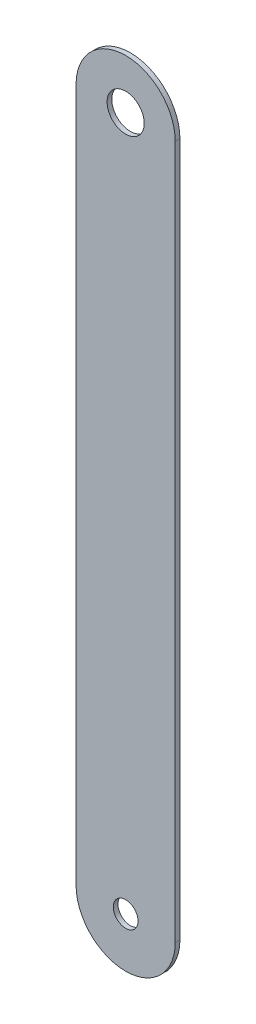
ISO-10303-21;
HEADER;
FILE_DESCRIPTION(('STEP AP214'),'2;1');
FILE_NAME('part.step','',(''),(''),'','','');
FILE_SCHEMA(('AUTOMOTIVE_DESIGN { 1 0 10303 214 1 1 1 1 }'));
ENDSEC;
DATA;
#1=APPLICATION_CONTEXT('core data for automotive mechanical design processes');
#2=APPLICATION_PROTOCOL_DEFINITION('international standard','automotive_design',2000,#1);
#3=PRODUCT_CONTEXT('',#1,'mechanical');
#4=PRODUCT('Part','Part','',(#3));
#5=PRODUCT_RELATED_PRODUCT_CATEGORY('part','',(#4));
#6=PRODUCT_DEFINITION_FORMATION('','',#4);
#7=PRODUCT_DEFINITION_CONTEXT('part definition',#1,'design');
#8=PRODUCT_DEFINITION('design','',#6,#7);
#9=PRODUCT_DEFINITION_SHAPE('','',#8);
#10=(LENGTH_UNIT() NAMED_UNIT(*) SI_UNIT(.MILLI.,.METRE.));
#11=(NAMED_UNIT(*) PLANE_ANGLE_UNIT() SI_UNIT($,.RADIAN.));
#12=(NAMED_UNIT(*) SI_UNIT($,.STERADIAN.) SOLID_ANGLE_UNIT());
#13=UNCERTAINTY_MEASURE_WITH_UNIT(LENGTH_MEASURE(1.E-05),#10,'distance_accuracy_value','');
#14=(GEOMETRIC_REPRESENTATION_CONTEXT(3) GLOBAL_UNCERTAINTY_ASSIGNED_CONTEXT((#13)) GLOBAL_UNIT_ASSIGNED_CONTEXT((#10,
#11,#12)) REPRESENTATION_CONTEXT('',''));
#15=CARTESIAN_POINT('',(0.,0.,0.));
#16=DIRECTION('',(0.,0.,1.));
#17=DIRECTION('',(1.,0.,0.));
#18=AXIS2_PLACEMENT_3D('',#15,#16,#17);
#19=CARTESIAN_POINT('',(0.,-88.9,1.2));
#20=DIRECTION('',(0.,0.,-1.));
#21=DIRECTION('',(-1.,0.,0.));
#22=AXIS2_PLACEMENT_3D('',#19,#20,#21);
#23=CYLINDRICAL_SURFACE('',#22,12.7);
#24=CARTESIAN_POINT('',(0.,-88.9,0.));
#25=DIRECTION('',(0.,0.,1.));
#26=DIRECTION('',(1.,0.,0.));
#27=AXIS2_PLACEMENT_3D('',#24,#25,#26);
#28=CIRCLE('',#27,12.7);
#29=CARTESIAN_POINT('',(-12.7,-88.9,0.));
#30=VERTEX_POINT('',#29);
#31=CARTESIAN_POINT('',(12.7,-88.9,0.));
#32=VERTEX_POINT('',#31);
#33=EDGE_CURVE('E104',#30,#32,#28,.T.);
#34=ORIENTED_EDGE('',*,*,#33,.T.);
#35=DIRECTION('',(0.,0.,-1.));
#36=VECTOR('',#35,1.);
#37=CARTESIAN_POINT('',(12.7,-88.9,1.2));
#38=LINE('',#37,#36);
#39=CARTESIAN_POINT('',(12.7,-88.9,1.2));
#40=VERTEX_POINT('',#39);
#41=EDGE_CURVE('E11',#40,#32,#38,.T.);
#42=ORIENTED_EDGE('',*,*,#41,.F.);
#43=CARTESIAN_POINT('',(0.,-88.9,1.2));
#44=DIRECTION('',(0.,0.,1.));
#45=DIRECTION('',(1.,0.,0.));
#46=AXIS2_PLACEMENT_3D('',#43,#44,#45);
#47=CIRCLE('',#46,12.7);
#48=CARTESIAN_POINT('',(-12.7,-88.9,1.2));
#49=VERTEX_POINT('',#48);
#50=EDGE_CURVE('E74',#49,#40,#47,.T.);
#51=ORIENTED_EDGE('',*,*,#50,.F.);
#52=DIRECTION('',(0.,0.,-1.));
#53=VECTOR('',#52,1.);
#54=CARTESIAN_POINT('',(-12.7,-88.9,1.2));
#55=LINE('',#54,#53);
#56=EDGE_CURVE('E103',#49,#30,#55,.T.);
#57=ORIENTED_EDGE('',*,*,#56,.T.);
#58=EDGE_LOOP('',(#34,#42,#51,#57));
#59=FACE_BOUND('',#58,.T.);
#60=ADVANCED_FACE('F35',(#59),#23,.T.);
#61=CARTESIAN_POINT('',(12.7,0.,1.2));
#62=DIRECTION('',(1.,0.,0.));
#63=DIRECTION('',(0.,1.,0.));
#64=AXIS2_PLACEMENT_3D('',#61,#62,#63);
#65=PLANE('',#64);
#66=DIRECTION('',(0.,-1.,0.));
#67=VECTOR('',#66,1.);
#68=CARTESIAN_POINT('',(12.7,0.,0.));
#69=LINE('',#68,#67);
#70=CARTESIAN_POINT('',(12.7,88.9,0.));
#71=VERTEX_POINT('',#70);
#72=EDGE_CURVE('E83',#71,#32,#69,.T.);
#73=ORIENTED_EDGE('',*,*,#72,.F.);
#74=DIRECTION('',(0.,0.,-1.));
#75=VECTOR('',#74,1.);
#76=CARTESIAN_POINT('',(12.7,88.9,1.2));
#77=LINE('',#76,#75);
#78=CARTESIAN_POINT('',(12.7,88.9,1.2));
#79=VERTEX_POINT('',#78);
#80=EDGE_CURVE('E43',#79,#71,#77,.T.);
#81=ORIENTED_EDGE('',*,*,#80,.F.);
#82=DIRECTION('',(0.,-1.,0.));
#83=VECTOR('',#82,1.);
#84=CARTESIAN_POINT('',(12.7,0.,1.2));
#85=LINE('',#84,#83);
#86=EDGE_CURVE('E81',#79,#40,#85,.T.);
#87=ORIENTED_EDGE('',*,*,#86,.T.);
#88=ORIENTED_EDGE('',*,*,#41,.T.);
#89=EDGE_LOOP('',(#73,#81,#87,#88));
#90=FACE_BOUND('',#89,.T.);
#91=ADVANCED_FACE('F80',(#90),#65,.T.);
#92=CARTESIAN_POINT('',(0.,88.9,1.2));
#93=DIRECTION('',(0.,0.,-1.));
#94=DIRECTION('',(-1.,0.,0.));
#95=AXIS2_PLACEMENT_3D('',#92,#93,#94);
#96=CYLINDRICAL_SURFACE('',#95,12.7);
#97=CARTESIAN_POINT('',(0.,88.9,0.));
#98=DIRECTION('',(0.,0.,1.));
#99=DIRECTION('',(1.,0.,0.));
#100=AXIS2_PLACEMENT_3D('',#97,#98,#99);
#101=CIRCLE('',#100,12.7);
#102=CARTESIAN_POINT('',(-12.7,88.9,0.));
#103=VERTEX_POINT('',#102);
#104=EDGE_CURVE('E108',#103,#71,#101,.F.);
#105=ORIENTED_EDGE('',*,*,#104,.F.);
#106=DIRECTION('',(0.,0.,-1.));
#107=VECTOR('',#106,1.);
#108=CARTESIAN_POINT('',(-12.7,88.9,1.2));
#109=LINE('',#108,#107);
#110=CARTESIAN_POINT('',(-12.7,88.9,1.2));
#111=VERTEX_POINT('',#110);
#112=EDGE_CURVE('E66',#111,#103,#109,.T.);
#113=ORIENTED_EDGE('',*,*,#112,.F.);
#114=CARTESIAN_POINT('',(0.,88.9,1.2));
#115=DIRECTION('',(0.,0.,1.));
#116=DIRECTION('',(1.,0.,0.));
#117=AXIS2_PLACEMENT_3D('',#114,#115,#116);
#118=CIRCLE('',#117,12.7);
#119=EDGE_CURVE('E90',#111,#79,#118,.F.);
#120=ORIENTED_EDGE('',*,*,#119,.T.);
#121=ORIENTED_EDGE('',*,*,#80,.T.);
#122=EDGE_LOOP('',(#105,#113,#120,#121));
#123=FACE_BOUND('',#122,.T.);
#124=ADVANCED_FACE('F92',(#123),#96,.T.);
#125=CARTESIAN_POINT('',(0.,-88.9,1.2));
#126=DIRECTION('',(0.,0.,-1.));
#127=DIRECTION('',(-1.,0.,0.));
#128=AXIS2_PLACEMENT_3D('',#125,#126,#127);
#129=CYLINDRICAL_SURFACE('',#128,3.175);
#130=CARTESIAN_POINT('',(0.,-88.9,1.2));
#131=DIRECTION('',(0.,0.,1.));
#132=DIRECTION('',(1.,0.,0.));
#133=AXIS2_PLACEMENT_3D('',#130,#131,#132);
#134=CIRCLE('',#133,3.175);
#135=CARTESIAN_POINT('',(3.17500000000001,-88.9,1.2));
#136=VERTEX_POINT('',#135);
#137=EDGE_CURVE('E94',#136,#136,#134,.T.);
#138=ORIENTED_EDGE('',*,*,#137,.T.);
#139=EDGE_LOOP('',(#138));
#140=FACE_BOUND('',#139,.T.);
#141=CARTESIAN_POINT('',(0.,-88.9,0.));
#142=DIRECTION('',(0.,0.,1.));
#143=DIRECTION('',(1.,0.,0.));
#144=AXIS2_PLACEMENT_3D('',#141,#142,#143);
#145=CIRCLE('',#144,3.175);
#146=CARTESIAN_POINT('',(3.17500000000001,-88.9,0.));
#147=VERTEX_POINT('',#146);
#148=EDGE_CURVE('E111',#147,#147,#145,.T.);
#149=ORIENTED_EDGE('',*,*,#148,.F.);
#150=EDGE_LOOP('',(#149));
#151=FACE_BOUND('',#150,.T.);
#152=ADVANCED_FACE('F139',(#140,#151),#129,.F.);
#153=CARTESIAN_POINT('',(-12.7,0.,1.2));
#154=DIRECTION('',(1.,0.,0.));
#155=DIRECTION('',(0.,1.,0.));
#156=AXIS2_PLACEMENT_3D('',#153,#154,#155);
#157=PLANE('',#156);
#158=DIRECTION('',(0.,-1.,0.));
#159=VECTOR('',#158,1.);
#160=CARTESIAN_POINT('',(-12.7,0.,0.));
#161=LINE('',#160,#159);
#162=EDGE_CURVE('E69',#103,#30,#161,.T.);
#163=ORIENTED_EDGE('',*,*,#162,.T.);
#164=ORIENTED_EDGE('',*,*,#56,.F.);
#165=DIRECTION('',(0.,-1.,0.));
#166=VECTOR('',#165,1.);
#167=CARTESIAN_POINT('',(-12.7,0.,1.2));
#168=LINE('',#167,#166);
#169=EDGE_CURVE('E51',#111,#49,#168,.T.);
#170=ORIENTED_EDGE('',*,*,#169,.F.);
#171=ORIENTED_EDGE('',*,*,#112,.T.);
#172=EDGE_LOOP('',(#163,#164,#170,#171));
#173=FACE_BOUND('',#172,.T.);
#174=ADVANCED_FACE('F131',(#173),#157,.F.);
#175=CARTESIAN_POINT('',(0.,88.9,1.2));
#176=DIRECTION('',(0.,0.,-1.));
#177=DIRECTION('',(-1.,0.,0.));
#178=AXIS2_PLACEMENT_3D('',#175,#176,#177);
#179=CYLINDRICAL_SURFACE('',#178,4.76249999999999);
#180=CARTESIAN_POINT('',(0.,88.9,1.2));
#181=DIRECTION('',(0.,0.,1.));
#182=DIRECTION('',(1.,0.,0.));
#183=AXIS2_PLACEMENT_3D('',#180,#181,#182);
#184=CIRCLE('',#183,4.76249999999999);
#185=CARTESIAN_POINT('',(4.76249999999998,88.9,1.2));
#186=VERTEX_POINT('',#185);
#187=EDGE_CURVE('E100',#186,#186,#184,.T.);
#188=ORIENTED_EDGE('',*,*,#187,.T.);
#189=EDGE_LOOP('',(#188));
#190=FACE_BOUND('',#189,.T.);
#191=CARTESIAN_POINT('',(0.,88.9,0.));
#192=DIRECTION('',(0.,0.,1.));
#193=DIRECTION('',(1.,0.,0.));
#194=AXIS2_PLACEMENT_3D('',#191,#192,#193);
#195=CIRCLE('',#194,4.76249999999999);
#196=CARTESIAN_POINT('',(4.76249999999998,88.9,0.));
#197=VERTEX_POINT('',#196);
#198=EDGE_CURVE('E114',#197,#197,#195,.T.);
#199=ORIENTED_EDGE('',*,*,#198,.F.);
#200=EDGE_LOOP('',(#199));
#201=FACE_BOUND('',#200,.T.);
#202=ADVANCED_FACE('F129',(#190,#201),#179,.F.);
#203=CARTESIAN_POINT('',(0.,0.,1.2));
#204=DIRECTION('',(0.,0.,1.));
#205=DIRECTION('',(1.,0.,0.));
#206=AXIS2_PLACEMENT_3D('',#203,#204,#205);
#207=PLANE('',#206);
#208=ORIENTED_EDGE('',*,*,#50,.T.);
#209=ORIENTED_EDGE('',*,*,#86,.F.);
#210=ORIENTED_EDGE('',*,*,#119,.F.);
#211=ORIENTED_EDGE('',*,*,#169,.T.);
#212=EDGE_LOOP('',(#208,#209,#210,#211));
#213=FACE_BOUND('',#212,.T.);
#214=ORIENTED_EDGE('',*,*,#137,.F.);
#215=EDGE_LOOP('',(#214));
#216=FACE_BOUND('',#215,.T.);
#217=ORIENTED_EDGE('',*,*,#187,.F.);
#218=EDGE_LOOP('',(#217));
#219=FACE_BOUND('',#218,.T.);
#220=ADVANCED_FACE('F88',(#213,#216,#219),#207,.T.);
#221=CARTESIAN_POINT('',(0.,0.,0.));
#222=DIRECTION('',(0.,0.,1.));
#223=DIRECTION('',(1.,0.,0.));
#224=AXIS2_PLACEMENT_3D('',#221,#222,#223);
#225=PLANE('',#224);
#226=ORIENTED_EDGE('',*,*,#33,.F.);
#227=ORIENTED_EDGE('',*,*,#162,.F.);
#228=ORIENTED_EDGE('',*,*,#104,.T.);
#229=ORIENTED_EDGE('',*,*,#72,.T.);
#230=EDGE_LOOP('',(#226,#227,#228,#229));
#231=FACE_BOUND('',#230,.T.);
#232=ORIENTED_EDGE('',*,*,#148,.T.);
#233=EDGE_LOOP('',(#232));
#234=FACE_BOUND('',#233,.T.);
#235=ORIENTED_EDGE('',*,*,#198,.T.);
#236=EDGE_LOOP('',(#235));
#237=FACE_BOUND('',#236,.T.);
#238=ADVANCED_FACE('F121',(#231,#234,#237),#225,.F.);
#239=CLOSED_SHELL('',(#60,#91,#124,#152,#174,#202,#220,#238));
#240=MANIFOLD_SOLID_BREP('B2',#239);
#241=ADVANCED_BREP_SHAPE_REPRESENTATION('',(#18,#240),#14);
#242=SHAPE_DEFINITION_REPRESENTATION(#9,#241);
ENDSEC;
END-ISO-10303-21;
